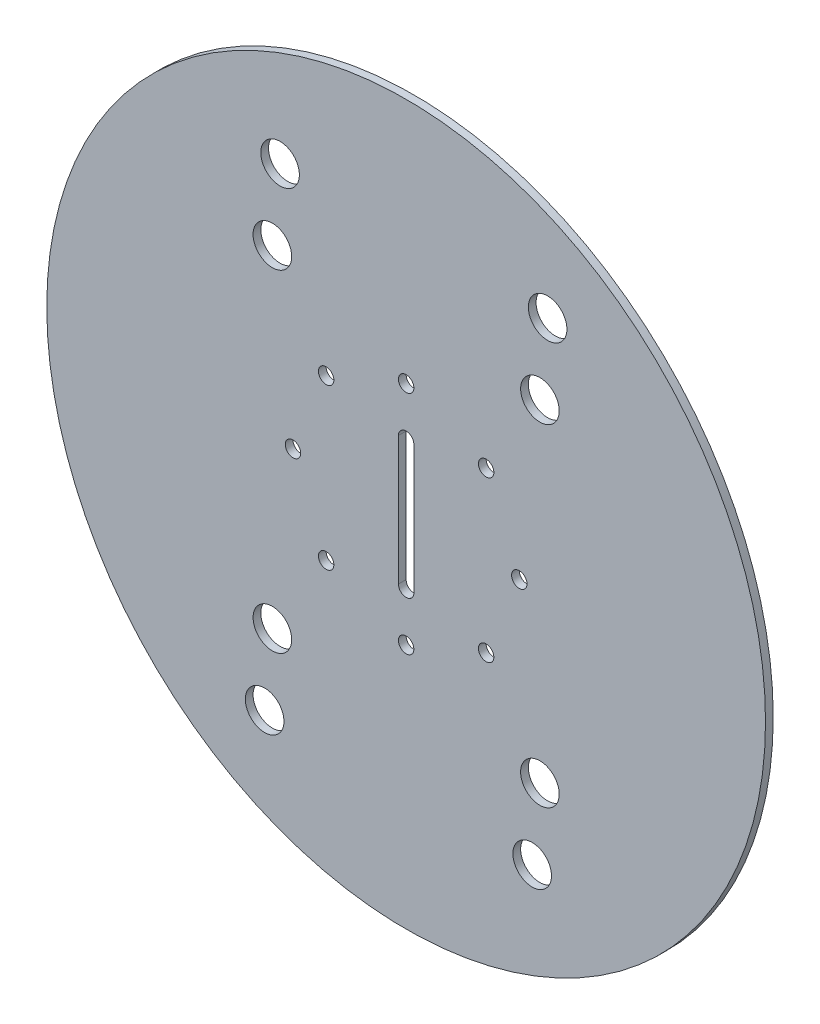
ISO-10303-21;
HEADER;
FILE_DESCRIPTION(('STEP AP214'),'2;1');
FILE_NAME('part.step','',(''),(''),'','','');
FILE_SCHEMA(('AUTOMOTIVE_DESIGN { 1 0 10303 214 1 1 1 1 }'));
ENDSEC;
DATA;
#1=APPLICATION_CONTEXT('core data for automotive mechanical design processes');
#2=APPLICATION_PROTOCOL_DEFINITION('international standard','automotive_design',2000,#1);
#3=PRODUCT_CONTEXT('',#1,'mechanical');
#4=PRODUCT('Part','Part','',(#3));
#5=PRODUCT_RELATED_PRODUCT_CATEGORY('part','',(#4));
#6=PRODUCT_DEFINITION_FORMATION('','',#4);
#7=PRODUCT_DEFINITION_CONTEXT('part definition',#1,'design');
#8=PRODUCT_DEFINITION('design','',#6,#7);
#9=PRODUCT_DEFINITION_SHAPE('','',#8);
#10=(LENGTH_UNIT() NAMED_UNIT(*) SI_UNIT(.MILLI.,.METRE.));
#11=(NAMED_UNIT(*) PLANE_ANGLE_UNIT() SI_UNIT($,.RADIAN.));
#12=(NAMED_UNIT(*) SI_UNIT($,.STERADIAN.) SOLID_ANGLE_UNIT());
#13=UNCERTAINTY_MEASURE_WITH_UNIT(LENGTH_MEASURE(1.E-05),#10,'distance_accuracy_value','');
#14=(GEOMETRIC_REPRESENTATION_CONTEXT(3) GLOBAL_UNCERTAINTY_ASSIGNED_CONTEXT((#13)) GLOBAL_UNIT_ASSIGNED_CONTEXT((#10,
#11,#12)) REPRESENTATION_CONTEXT('',''));
#15=CARTESIAN_POINT('',(0.,0.,0.));
#16=DIRECTION('',(0.,0.,1.));
#17=DIRECTION('',(1.,0.,0.));
#18=AXIS2_PLACEMENT_3D('',#15,#16,#17);
#19=CARTESIAN_POINT('',(0.,0.,3.));
#20=DIRECTION('',(0.,0.,-1.));
#21=DIRECTION('',(-1.,0.,0.));
#22=AXIS2_PLACEMENT_3D('',#19,#20,#21);
#23=CYLINDRICAL_SURFACE('',#22,139.700000000005);
#24=CARTESIAN_POINT('',(0.,0.,3.));
#25=DIRECTION('',(0.,0.,1.));
#26=DIRECTION('',(1.,0.,0.));
#27=AXIS2_PLACEMENT_3D('',#24,#25,#26);
#28=CIRCLE('',#27,139.700000000005);
#29=CARTESIAN_POINT('',(139.700000000005,0.,3.));
#30=VERTEX_POINT('',#29);
#31=EDGE_CURVE('E11',#30,#30,#28,.T.);
#32=ORIENTED_EDGE('',*,*,#31,.F.);
#33=EDGE_LOOP('',(#32));
#34=FACE_BOUND('',#33,.T.);
#35=CARTESIAN_POINT('',(0.,0.,0.));
#36=DIRECTION('',(0.,0.,1.));
#37=DIRECTION('',(1.,0.,0.));
#38=AXIS2_PLACEMENT_3D('',#35,#36,#37);
#39=CIRCLE('',#38,139.700000000005);
#40=CARTESIAN_POINT('',(139.700000000005,0.,0.));
#41=VERTEX_POINT('',#40);
#42=EDGE_CURVE('E35',#41,#41,#39,.T.);
#43=ORIENTED_EDGE('',*,*,#42,.T.);
#44=EDGE_LOOP('',(#43));
#45=FACE_BOUND('',#44,.T.);
#46=ADVANCED_FACE('F32',(#34,#45),#23,.T.);
#47=CARTESIAN_POINT('',(0.,0.,3.));
#48=DIRECTION('',(0.,0.,1.));
#49=DIRECTION('',(1.,0.,0.));
#50=AXIS2_PLACEMENT_3D('',#47,#48,#49);
#51=PLANE('',#50);
#52=CARTESIAN_POINT('',(-48.9999999999994,93.5000000000003,3.));
#53=DIRECTION('',(0.,0.,1.));
#54=DIRECTION('',(1.,0.,0.));
#55=AXIS2_PLACEMENT_3D('',#52,#53,#54);
#56=CIRCLE('',#55,7.50000000000002);
#57=CARTESIAN_POINT('',(-41.4999999999994,93.5000000000003,3.));
#58=VERTEX_POINT('',#57);
#59=EDGE_CURVE('E221',#58,#58,#56,.T.);
#60=ORIENTED_EDGE('',*,*,#59,.F.);
#61=EDGE_LOOP('',(#60));
#62=FACE_BOUND('',#61,.T.);
#63=CARTESIAN_POINT('',(-51.9999999999996,64.5000000000003,3.));
#64=DIRECTION('',(0.,0.,1.));
#65=DIRECTION('',(-1.,0.,0.));
#66=AXIS2_PLACEMENT_3D('',#63,#64,#65);
#67=CIRCLE('',#66,7.5);
#68=CARTESIAN_POINT('',(-59.4999999999996,64.5000000000003,3.));
#69=VERTEX_POINT('',#68);
#70=EDGE_CURVE('E223',#69,#69,#67,.T.);
#71=ORIENTED_EDGE('',*,*,#70,.F.);
#72=EDGE_LOOP('',(#71));
#73=FACE_BOUND('',#72,.T.);
#74=CARTESIAN_POINT('',(49.,-93.5,3.));
#75=DIRECTION('',(0.,0.,1.));
#76=DIRECTION('',(1.,0.,0.));
#77=AXIS2_PLACEMENT_3D('',#74,#75,#76);
#78=CIRCLE('',#77,7.50000000000001);
#79=CARTESIAN_POINT('',(56.5000000000001,-93.5,3.));
#80=VERTEX_POINT('',#79);
#81=EDGE_CURVE('E229',#80,#80,#78,.T.);
#82=ORIENTED_EDGE('',*,*,#81,.F.);
#83=EDGE_LOOP('',(#82));
#84=FACE_BOUND('',#83,.T.);
#85=CARTESIAN_POINT('',(55.0000000000006,93.4999999999996,3.));
#86=DIRECTION('',(0.,0.,1.));
#87=DIRECTION('',(1.,0.,0.));
#88=AXIS2_PLACEMENT_3D('',#85,#86,#87);
#89=CIRCLE('',#88,7.50000000000001);
#90=CARTESIAN_POINT('',(62.5000000000006,93.4999999999996,3.));
#91=VERTEX_POINT('',#90);
#92=EDGE_CURVE('E235',#91,#91,#89,.T.);
#93=ORIENTED_EDGE('',*,*,#92,.F.);
#94=EDGE_LOOP('',(#93));
#95=FACE_BOUND('',#94,.T.);
#96=CARTESIAN_POINT('',(52.0000000000004,64.4999999999996,3.));
#97=DIRECTION('',(0.,0.,1.));
#98=DIRECTION('',(1.,0.,0.));
#99=AXIS2_PLACEMENT_3D('',#96,#97,#98);
#100=CIRCLE('',#99,7.5);
#101=CARTESIAN_POINT('',(59.5000000000004,64.4999999999996,3.));
#102=VERTEX_POINT('',#101);
#103=EDGE_CURVE('E241',#102,#102,#100,.T.);
#104=ORIENTED_EDGE('',*,*,#103,.F.);
#105=EDGE_LOOP('',(#104));
#106=FACE_BOUND('',#105,.T.);
#107=CARTESIAN_POINT('',(52.,-64.4999999999999,3.));
#108=DIRECTION('',(0.,0.,1.));
#109=DIRECTION('',(-1.,0.,0.));
#110=AXIS2_PLACEMENT_3D('',#107,#108,#109);
#111=CIRCLE('',#110,7.5);
#112=CARTESIAN_POINT('',(44.5,-64.4999999999999,3.));
#113=VERTEX_POINT('',#112);
#114=EDGE_CURVE('E247',#113,#113,#111,.T.);
#115=ORIENTED_EDGE('',*,*,#114,.F.);
#116=EDGE_LOOP('',(#115));
#117=FACE_BOUND('',#116,.T.);
#118=CARTESIAN_POINT('',(-55.,-93.5,3.));
#119=DIRECTION('',(0.,0.,1.));
#120=DIRECTION('',(1.,0.,0.));
#121=AXIS2_PLACEMENT_3D('',#118,#119,#120);
#122=CIRCLE('',#121,7.50000000000001);
#123=CARTESIAN_POINT('',(-47.5,-93.5,3.));
#124=VERTEX_POINT('',#123);
#125=EDGE_CURVE('E253',#124,#124,#122,.T.);
#126=ORIENTED_EDGE('',*,*,#125,.F.);
#127=EDGE_LOOP('',(#126));
#128=FACE_BOUND('',#127,.T.);
#129=CARTESIAN_POINT('',(-52.,-64.5,3.));
#130=DIRECTION('',(0.,0.,1.));
#131=DIRECTION('',(1.,0.,0.));
#132=AXIS2_PLACEMENT_3D('',#129,#130,#131);
#133=CIRCLE('',#132,7.5);
#134=CARTESIAN_POINT('',(-44.5,-64.5,3.));
#135=VERTEX_POINT('',#134);
#136=EDGE_CURVE('E259',#135,#135,#133,.T.);
#137=ORIENTED_EDGE('',*,*,#136,.F.);
#138=EDGE_LOOP('',(#137));
#139=FACE_BOUND('',#138,.T.);
#140=CARTESIAN_POINT('',(-31.0988118755293,31.0988118755301,3.));
#141=DIRECTION('',(0.,0.,1.));
#142=DIRECTION('',(1.,0.,0.));
#143=AXIS2_PLACEMENT_3D('',#140,#141,#142);
#144=CIRCLE('',#143,3.00000000000001);
#145=CARTESIAN_POINT('',(-28.0988118755293,31.0988118755301,3.));
#146=VERTEX_POINT('',#145);
#147=EDGE_CURVE('E265',#146,#146,#144,.T.);
#148=ORIENTED_EDGE('',*,*,#147,.F.);
#149=EDGE_LOOP('',(#148));
#150=FACE_BOUND('',#149,.T.);
#151=CARTESIAN_POINT('',(-43.9803615280636,4.88317124566267E-13,3.));
#152=DIRECTION('',(0.,0.,1.));
#153=DIRECTION('',(1.,0.,0.));
#154=AXIS2_PLACEMENT_3D('',#151,#152,#153);
#155=CIRCLE('',#154,3.);
#156=CARTESIAN_POINT('',(-40.9803615280636,4.88317124566267E-13,3.));
#157=VERTEX_POINT('',#156);
#158=EDGE_CURVE('E271',#157,#157,#155,.T.);
#159=ORIENTED_EDGE('',*,*,#158,.F.);
#160=EDGE_LOOP('',(#159));
#161=FACE_BOUND('',#160,.T.);
#162=CARTESIAN_POINT('',(-31.09881187553,-31.0988118755294,3.));
#163=DIRECTION('',(0.,0.,1.));
#164=DIRECTION('',(1.,0.,0.));
#165=AXIS2_PLACEMENT_3D('',#162,#163,#164);
#166=CIRCLE('',#165,3.00000000000001);
#167=CARTESIAN_POINT('',(-28.09881187553,-31.0988118755294,3.));
#168=VERTEX_POINT('',#167);
#169=EDGE_CURVE('E277',#168,#168,#166,.T.);
#170=ORIENTED_EDGE('',*,*,#169,.F.);
#171=EDGE_LOOP('',(#170));
#172=FACE_BOUND('',#171,.T.);
#173=CARTESIAN_POINT('',(-3.36950293566904E-13,-43.9803615280636,3.));
#174=DIRECTION('',(0.,0.,1.));
#175=DIRECTION('',(1.,0.,0.));
#176=AXIS2_PLACEMENT_3D('',#173,#174,#175);
#177=CIRCLE('',#176,3.);
#178=CARTESIAN_POINT('',(2.99999999999966,-43.9803615280636,3.));
#179=VERTEX_POINT('',#178);
#180=EDGE_CURVE('E283',#179,#179,#177,.T.);
#181=ORIENTED_EDGE('',*,*,#180,.F.);
#182=EDGE_LOOP('',(#181));
#183=FACE_BOUND('',#182,.T.);
#184=CARTESIAN_POINT('',(31.0988118755295,-31.0988118755281,3.));
#185=DIRECTION('',(0.,0.,1.));
#186=DIRECTION('',(1.,0.,0.));
#187=AXIS2_PLACEMENT_3D('',#184,#185,#186);
#188=CIRCLE('',#187,3.000000000002);
#189=CARTESIAN_POINT('',(34.0988118755315,-31.0988118755281,3.));
#190=VERTEX_POINT('',#189);
#191=EDGE_CURVE('E289',#190,#190,#188,.T.);
#192=ORIENTED_EDGE('',*,*,#191,.F.);
#193=EDGE_LOOP('',(#192));
#194=FACE_BOUND('',#193,.T.);
#195=CARTESIAN_POINT('',(43.9803615280636,1.67433452766419E-12,3.));
#196=DIRECTION('',(0.,0.,1.));
#197=DIRECTION('',(1.,0.,0.));
#198=AXIS2_PLACEMENT_3D('',#195,#196,#197);
#199=CIRCLE('',#198,3.00000000000267);
#200=CARTESIAN_POINT('',(46.9803615280662,1.67433452766419E-12,3.));
#201=VERTEX_POINT('',#200);
#202=EDGE_CURVE('E295',#201,#201,#199,.T.);
#203=ORIENTED_EDGE('',*,*,#202,.F.);
#204=EDGE_LOOP('',(#203));
#205=FACE_BOUND('',#204,.T.);
#206=CARTESIAN_POINT('',(31.0988118755293,31.0988118755301,3.));
#207=DIRECTION('',(0.,0.,1.));
#208=DIRECTION('',(1.,0.,0.));
#209=AXIS2_PLACEMENT_3D('',#206,#207,#208);
#210=CIRCLE('',#209,3.);
#211=CARTESIAN_POINT('',(34.0988118755293,31.0988118755301,3.));
#212=VERTEX_POINT('',#211);
#213=EDGE_CURVE('E96',#212,#212,#210,.T.);
#214=ORIENTED_EDGE('',*,*,#213,.F.);
#215=EDGE_LOOP('',(#214));
#216=FACE_BOUND('',#215,.T.);
#217=CARTESIAN_POINT('',(0.,25.,3.));
#218=DIRECTION('',(0.,0.,1.));
#219=DIRECTION('',(-1.,0.,0.));
#220=AXIS2_PLACEMENT_3D('',#217,#218,#219);
#221=CIRCLE('',#220,3.);
#222=CARTESIAN_POINT('',(3.,25.,3.));
#223=VERTEX_POINT('',#222);
#224=CARTESIAN_POINT('',(-3.,25.,3.));
#225=VERTEX_POINT('',#224);
#226=EDGE_CURVE('E46',#223,#225,#221,.T.);
#227=ORIENTED_EDGE('',*,*,#226,.F.);
#228=DIRECTION('',(0.,1.,0.));
#229=VECTOR('',#228,1.);
#230=CARTESIAN_POINT('',(3.,-25.,3.));
#231=LINE('',#230,#229);
#232=CARTESIAN_POINT('',(3.00000000000003,-25.,3.));
#233=VERTEX_POINT('',#232);
#234=EDGE_CURVE('E90',#233,#223,#231,.T.);
#235=ORIENTED_EDGE('',*,*,#234,.F.);
#236=CARTESIAN_POINT('',(0.,-25.,3.));
#237=DIRECTION('',(0.,0.,1.));
#238=DIRECTION('',(1.,0.,0.));
#239=AXIS2_PLACEMENT_3D('',#236,#237,#238);
#240=CIRCLE('',#239,3.);
#241=CARTESIAN_POINT('',(-3.,-25.,3.));
#242=VERTEX_POINT('',#241);
#243=EDGE_CURVE('E93',#242,#233,#240,.T.);
#244=ORIENTED_EDGE('',*,*,#243,.F.);
#245=DIRECTION('',(0.,-1.,0.));
#246=VECTOR('',#245,1.);
#247=CARTESIAN_POINT('',(-3.,-25.,3.));
#248=LINE('',#247,#246);
#249=EDGE_CURVE('E102',#225,#242,#248,.T.);
#250=ORIENTED_EDGE('',*,*,#249,.F.);
#251=EDGE_LOOP('',(#227,#235,#244,#250));
#252=FACE_BOUND('',#251,.T.);
#253=CARTESIAN_POINT('',(0.,43.9803615280636,3.));
#254=DIRECTION('',(0.,0.,1.));
#255=DIRECTION('',(1.,0.,0.));
#256=AXIS2_PLACEMENT_3D('',#253,#254,#255);
#257=CIRCLE('',#256,3.);
#258=CARTESIAN_POINT('',(3.00000000000004,43.9803615280636,3.));
#259=VERTEX_POINT('',#258);
#260=EDGE_CURVE('E109',#259,#259,#257,.T.);
#261=ORIENTED_EDGE('',*,*,#260,.F.);
#262=EDGE_LOOP('',(#261));
#263=FACE_BOUND('',#262,.T.);
#264=ORIENTED_EDGE('',*,*,#31,.T.);
#265=EDGE_LOOP('',(#264));
#266=FACE_BOUND('',#265,.T.);
#267=ADVANCED_FACE('F121',(#62,#73,#84,#95,#106,#117,#128,#139,#150,#161,#172,#183,#194,#205,
#216,#252,#263,#266),#51,.T.);
#268=CARTESIAN_POINT('',(0.,0.,0.));
#269=DIRECTION('',(0.,0.,1.));
#270=DIRECTION('',(1.,0.,0.));
#271=AXIS2_PLACEMENT_3D('',#268,#269,#270);
#272=PLANE('',#271);
#273=CARTESIAN_POINT('',(-48.9999999999994,93.5000000000003,0.));
#274=DIRECTION('',(0.,0.,1.));
#275=DIRECTION('',(1.,0.,0.));
#276=AXIS2_PLACEMENT_3D('',#273,#274,#275);
#277=CIRCLE('',#276,7.50000000000002);
#278=CARTESIAN_POINT('',(-41.4999999999994,93.5000000000003,0.));
#279=VERTEX_POINT('',#278);
#280=EDGE_CURVE('E218',#279,#279,#277,.T.);
#281=ORIENTED_EDGE('',*,*,#280,.T.);
#282=EDGE_LOOP('',(#281));
#283=FACE_BOUND('',#282,.T.);
#284=CARTESIAN_POINT('',(-51.9999999999996,64.5000000000003,0.));
#285=DIRECTION('',(0.,0.,1.));
#286=DIRECTION('',(-1.,0.,0.));
#287=AXIS2_PLACEMENT_3D('',#284,#285,#286);
#288=CIRCLE('',#287,7.5);
#289=CARTESIAN_POINT('',(-59.4999999999996,64.5000000000003,0.));
#290=VERTEX_POINT('',#289);
#291=EDGE_CURVE('E226',#290,#290,#288,.T.);
#292=ORIENTED_EDGE('',*,*,#291,.T.);
#293=EDGE_LOOP('',(#292));
#294=FACE_BOUND('',#293,.T.);
#295=CARTESIAN_POINT('',(49.,-93.5,0.));
#296=DIRECTION('',(0.,0.,1.));
#297=DIRECTION('',(1.,0.,0.));
#298=AXIS2_PLACEMENT_3D('',#295,#296,#297);
#299=CIRCLE('',#298,7.50000000000001);
#300=CARTESIAN_POINT('',(56.5000000000001,-93.5,0.));
#301=VERTEX_POINT('',#300);
#302=EDGE_CURVE('E232',#301,#301,#299,.T.);
#303=ORIENTED_EDGE('',*,*,#302,.T.);
#304=EDGE_LOOP('',(#303));
#305=FACE_BOUND('',#304,.T.);
#306=CARTESIAN_POINT('',(55.0000000000006,93.4999999999996,0.));
#307=DIRECTION('',(0.,0.,1.));
#308=DIRECTION('',(1.,0.,0.));
#309=AXIS2_PLACEMENT_3D('',#306,#307,#308);
#310=CIRCLE('',#309,7.50000000000001);
#311=CARTESIAN_POINT('',(62.5000000000006,93.4999999999996,0.));
#312=VERTEX_POINT('',#311);
#313=EDGE_CURVE('E238',#312,#312,#310,.T.);
#314=ORIENTED_EDGE('',*,*,#313,.T.);
#315=EDGE_LOOP('',(#314));
#316=FACE_BOUND('',#315,.T.);
#317=CARTESIAN_POINT('',(52.0000000000004,64.4999999999996,0.));
#318=DIRECTION('',(0.,0.,1.));
#319=DIRECTION('',(1.,0.,0.));
#320=AXIS2_PLACEMENT_3D('',#317,#318,#319);
#321=CIRCLE('',#320,7.5);
#322=CARTESIAN_POINT('',(59.5000000000004,64.4999999999996,0.));
#323=VERTEX_POINT('',#322);
#324=EDGE_CURVE('E244',#323,#323,#321,.T.);
#325=ORIENTED_EDGE('',*,*,#324,.T.);
#326=EDGE_LOOP('',(#325));
#327=FACE_BOUND('',#326,.T.);
#328=CARTESIAN_POINT('',(52.,-64.4999999999999,0.));
#329=DIRECTION('',(0.,0.,1.));
#330=DIRECTION('',(-1.,0.,0.));
#331=AXIS2_PLACEMENT_3D('',#328,#329,#330);
#332=CIRCLE('',#331,7.5);
#333=CARTESIAN_POINT('',(44.5,-64.4999999999999,0.));
#334=VERTEX_POINT('',#333);
#335=EDGE_CURVE('E250',#334,#334,#332,.T.);
#336=ORIENTED_EDGE('',*,*,#335,.T.);
#337=EDGE_LOOP('',(#336));
#338=FACE_BOUND('',#337,.T.);
#339=CARTESIAN_POINT('',(-55.,-93.5,0.));
#340=DIRECTION('',(0.,0.,1.));
#341=DIRECTION('',(1.,0.,0.));
#342=AXIS2_PLACEMENT_3D('',#339,#340,#341);
#343=CIRCLE('',#342,7.50000000000001);
#344=CARTESIAN_POINT('',(-47.5,-93.5,0.));
#345=VERTEX_POINT('',#344);
#346=EDGE_CURVE('E256',#345,#345,#343,.T.);
#347=ORIENTED_EDGE('',*,*,#346,.T.);
#348=EDGE_LOOP('',(#347));
#349=FACE_BOUND('',#348,.T.);
#350=CARTESIAN_POINT('',(-52.,-64.5,0.));
#351=DIRECTION('',(0.,0.,1.));
#352=DIRECTION('',(1.,0.,0.));
#353=AXIS2_PLACEMENT_3D('',#350,#351,#352);
#354=CIRCLE('',#353,7.5);
#355=CARTESIAN_POINT('',(-44.5,-64.5,0.));
#356=VERTEX_POINT('',#355);
#357=EDGE_CURVE('E262',#356,#356,#354,.T.);
#358=ORIENTED_EDGE('',*,*,#357,.T.);
#359=EDGE_LOOP('',(#358));
#360=FACE_BOUND('',#359,.T.);
#361=CARTESIAN_POINT('',(-31.0988118755293,31.0988118755301,0.));
#362=DIRECTION('',(0.,0.,1.));
#363=DIRECTION('',(1.,0.,0.));
#364=AXIS2_PLACEMENT_3D('',#361,#362,#363);
#365=CIRCLE('',#364,3.00000000000001);
#366=CARTESIAN_POINT('',(-28.0988118755293,31.0988118755301,0.));
#367=VERTEX_POINT('',#366);
#368=EDGE_CURVE('E268',#367,#367,#365,.T.);
#369=ORIENTED_EDGE('',*,*,#368,.T.);
#370=EDGE_LOOP('',(#369));
#371=FACE_BOUND('',#370,.T.);
#372=CARTESIAN_POINT('',(-43.9803615280636,4.88317124566267E-13,0.));
#373=DIRECTION('',(0.,0.,1.));
#374=DIRECTION('',(1.,0.,0.));
#375=AXIS2_PLACEMENT_3D('',#372,#373,#374);
#376=CIRCLE('',#375,3.);
#377=CARTESIAN_POINT('',(-40.9803615280636,4.88317124566267E-13,0.));
#378=VERTEX_POINT('',#377);
#379=EDGE_CURVE('E274',#378,#378,#376,.T.);
#380=ORIENTED_EDGE('',*,*,#379,.T.);
#381=EDGE_LOOP('',(#380));
#382=FACE_BOUND('',#381,.T.);
#383=CARTESIAN_POINT('',(-31.09881187553,-31.0988118755294,0.));
#384=DIRECTION('',(0.,0.,1.));
#385=DIRECTION('',(1.,0.,0.));
#386=AXIS2_PLACEMENT_3D('',#383,#384,#385);
#387=CIRCLE('',#386,3.00000000000001);
#388=CARTESIAN_POINT('',(-28.09881187553,-31.0988118755294,0.));
#389=VERTEX_POINT('',#388);
#390=EDGE_CURVE('E280',#389,#389,#387,.T.);
#391=ORIENTED_EDGE('',*,*,#390,.T.);
#392=EDGE_LOOP('',(#391));
#393=FACE_BOUND('',#392,.T.);
#394=CARTESIAN_POINT('',(-3.36950293566904E-13,-43.9803615280636,0.));
#395=DIRECTION('',(0.,0.,1.));
#396=DIRECTION('',(1.,0.,0.));
#397=AXIS2_PLACEMENT_3D('',#394,#395,#396);
#398=CIRCLE('',#397,3.);
#399=CARTESIAN_POINT('',(2.99999999999966,-43.9803615280636,0.));
#400=VERTEX_POINT('',#399);
#401=EDGE_CURVE('E286',#400,#400,#398,.T.);
#402=ORIENTED_EDGE('',*,*,#401,.T.);
#403=EDGE_LOOP('',(#402));
#404=FACE_BOUND('',#403,.T.);
#405=CARTESIAN_POINT('',(31.0988118755295,-31.0988118755281,0.));
#406=DIRECTION('',(0.,0.,1.));
#407=DIRECTION('',(1.,0.,0.));
#408=AXIS2_PLACEMENT_3D('',#405,#406,#407);
#409=CIRCLE('',#408,3.000000000002);
#410=CARTESIAN_POINT('',(34.0988118755315,-31.0988118755281,0.));
#411=VERTEX_POINT('',#410);
#412=EDGE_CURVE('E292',#411,#411,#409,.T.);
#413=ORIENTED_EDGE('',*,*,#412,.T.);
#414=EDGE_LOOP('',(#413));
#415=FACE_BOUND('',#414,.T.);
#416=CARTESIAN_POINT('',(43.9803615280636,1.67433452766419E-12,0.));
#417=DIRECTION('',(0.,0.,1.));
#418=DIRECTION('',(1.,0.,0.));
#419=AXIS2_PLACEMENT_3D('',#416,#417,#418);
#420=CIRCLE('',#419,3.00000000000267);
#421=CARTESIAN_POINT('',(46.9803615280662,1.67433452766419E-12,0.));
#422=VERTEX_POINT('',#421);
#423=EDGE_CURVE('E298',#422,#422,#420,.T.);
#424=ORIENTED_EDGE('',*,*,#423,.T.);
#425=EDGE_LOOP('',(#424));
#426=FACE_BOUND('',#425,.T.);
#427=CARTESIAN_POINT('',(31.0988118755293,31.0988118755301,0.));
#428=DIRECTION('',(0.,0.,1.));
#429=DIRECTION('',(1.,0.,0.));
#430=AXIS2_PLACEMENT_3D('',#427,#428,#429);
#431=CIRCLE('',#430,3.);
#432=CARTESIAN_POINT('',(34.0988118755293,31.0988118755301,0.));
#433=VERTEX_POINT('',#432);
#434=EDGE_CURVE('E103',#433,#433,#431,.T.);
#435=ORIENTED_EDGE('',*,*,#434,.T.);
#436=EDGE_LOOP('',(#435));
#437=FACE_BOUND('',#436,.T.);
#438=DIRECTION('',(0.,1.,0.));
#439=VECTOR('',#438,1.);
#440=CARTESIAN_POINT('',(3.,-25.,0.));
#441=LINE('',#440,#439);
#442=CARTESIAN_POINT('',(3.00000000000003,-25.,0.));
#443=VERTEX_POINT('',#442);
#444=CARTESIAN_POINT('',(3.,25.,0.));
#445=VERTEX_POINT('',#444);
#446=EDGE_CURVE('E80',#443,#445,#441,.T.);
#447=ORIENTED_EDGE('',*,*,#446,.T.);
#448=CARTESIAN_POINT('',(0.,25.,0.));
#449=DIRECTION('',(0.,0.,1.));
#450=DIRECTION('',(-1.,0.,0.));
#451=AXIS2_PLACEMENT_3D('',#448,#449,#450);
#452=CIRCLE('',#451,3.);
#453=CARTESIAN_POINT('',(-3.,25.,0.));
#454=VERTEX_POINT('',#453);
#455=EDGE_CURVE('E74',#445,#454,#452,.T.);
#456=ORIENTED_EDGE('',*,*,#455,.T.);
#457=DIRECTION('',(0.,-1.,0.));
#458=VECTOR('',#457,1.);
#459=CARTESIAN_POINT('',(-3.,-25.,0.));
#460=LINE('',#459,#458);
#461=CARTESIAN_POINT('',(-3.,-25.,0.));
#462=VERTEX_POINT('',#461);
#463=EDGE_CURVE('E83',#454,#462,#460,.T.);
#464=ORIENTED_EDGE('',*,*,#463,.T.);
#465=CARTESIAN_POINT('',(0.,-25.,0.));
#466=DIRECTION('',(0.,0.,1.));
#467=DIRECTION('',(1.,0.,0.));
#468=AXIS2_PLACEMENT_3D('',#465,#466,#467);
#469=CIRCLE('',#468,3.);
#470=EDGE_CURVE('E54',#462,#443,#469,.T.);
#471=ORIENTED_EDGE('',*,*,#470,.T.);
#472=EDGE_LOOP('',(#447,#456,#464,#471));
#473=FACE_BOUND('',#472,.T.);
#474=CARTESIAN_POINT('',(0.,43.9803615280636,0.));
#475=DIRECTION('',(0.,0.,1.));
#476=DIRECTION('',(1.,0.,0.));
#477=AXIS2_PLACEMENT_3D('',#474,#475,#476);
#478=CIRCLE('',#477,3.);
#479=CARTESIAN_POINT('',(3.00000000000004,43.9803615280636,0.));
#480=VERTEX_POINT('',#479);
#481=EDGE_CURVE('E113',#480,#480,#478,.T.);
#482=ORIENTED_EDGE('',*,*,#481,.T.);
#483=EDGE_LOOP('',(#482));
#484=FACE_BOUND('',#483,.T.);
#485=ORIENTED_EDGE('',*,*,#42,.F.);
#486=EDGE_LOOP('',(#485));
#487=FACE_BOUND('',#486,.T.);
#488=ADVANCED_FACE('F87',(#283,#294,#305,#316,#327,#338,#349,#360,#371,#382,#393,#404,#415,#426,
#437,#473,#484,#487),#272,.F.);
#489=CARTESIAN_POINT('',(0.,43.9803615280636,0.));
#490=DIRECTION('',(0.,0.,1.));
#491=DIRECTION('',(1.,0.,0.));
#492=AXIS2_PLACEMENT_3D('',#489,#490,#491);
#493=CYLINDRICAL_SURFACE('',#492,3.);
#494=ORIENTED_EDGE('',*,*,#481,.F.);
#495=EDGE_LOOP('',(#494));
#496=FACE_BOUND('',#495,.T.);
#497=ORIENTED_EDGE('',*,*,#260,.T.);
#498=EDGE_LOOP('',(#497));
#499=FACE_BOUND('',#498,.T.);
#500=ADVANCED_FACE('F119',(#496,#499),#493,.F.);
#501=CARTESIAN_POINT('',(0.,25.,0.));
#502=DIRECTION('',(0.,0.,1.));
#503=DIRECTION('',(1.,0.,0.));
#504=AXIS2_PLACEMENT_3D('',#501,#502,#503);
#505=CYLINDRICAL_SURFACE('',#504,3.);
#506=ORIENTED_EDGE('',*,*,#226,.T.);
#507=DIRECTION('',(0.,0.,1.));
#508=VECTOR('',#507,1.);
#509=CARTESIAN_POINT('',(-3.,25.,0.));
#510=LINE('',#509,#508);
#511=EDGE_CURVE('E70',#454,#225,#510,.T.);
#512=ORIENTED_EDGE('',*,*,#511,.F.);
#513=ORIENTED_EDGE('',*,*,#455,.F.);
#514=DIRECTION('',(0.,0.,1.));
#515=VECTOR('',#514,1.);
#516=CARTESIAN_POINT('',(3.,25.,0.));
#517=LINE('',#516,#515);
#518=EDGE_CURVE('E107',#445,#223,#517,.T.);
#519=ORIENTED_EDGE('',*,*,#518,.T.);
#520=EDGE_LOOP('',(#506,#512,#513,#519));
#521=FACE_BOUND('',#520,.T.);
#522=ADVANCED_FACE('F72',(#521),#505,.F.);
#523=CARTESIAN_POINT('',(3.,-25.,0.));
#524=DIRECTION('',(1.,0.,0.));
#525=DIRECTION('',(0.,0.,-1.));
#526=AXIS2_PLACEMENT_3D('',#523,#524,#525);
#527=PLANE('',#526);
#528=ORIENTED_EDGE('',*,*,#234,.T.);
#529=ORIENTED_EDGE('',*,*,#518,.F.);
#530=ORIENTED_EDGE('',*,*,#446,.F.);
#531=DIRECTION('',(0.,0.,1.));
#532=VECTOR('',#531,1.);
#533=CARTESIAN_POINT('',(3.00000000000003,-25.,0.));
#534=LINE('',#533,#532);
#535=EDGE_CURVE('E110',#443,#233,#534,.T.);
#536=ORIENTED_EDGE('',*,*,#535,.T.);
#537=EDGE_LOOP('',(#528,#529,#530,#536));
#538=FACE_BOUND('',#537,.T.);
#539=ADVANCED_FACE('F146',(#538),#527,.F.);
#540=CARTESIAN_POINT('',(0.,-25.,0.));
#541=DIRECTION('',(0.,0.,1.));
#542=DIRECTION('',(1.,0.,0.));
#543=AXIS2_PLACEMENT_3D('',#540,#541,#542);
#544=CYLINDRICAL_SURFACE('',#543,3.);
#545=ORIENTED_EDGE('',*,*,#243,.T.);
#546=ORIENTED_EDGE('',*,*,#535,.F.);
#547=ORIENTED_EDGE('',*,*,#470,.F.);
#548=DIRECTION('',(0.,0.,1.));
#549=VECTOR('',#548,1.);
#550=CARTESIAN_POINT('',(-3.,-25.,0.));
#551=LINE('',#550,#549);
#552=EDGE_CURVE('E79',#462,#242,#551,.T.);
#553=ORIENTED_EDGE('',*,*,#552,.T.);
#554=EDGE_LOOP('',(#545,#546,#547,#553));
#555=FACE_BOUND('',#554,.T.);
#556=ADVANCED_FACE('F150',(#555),#544,.F.);
#557=CARTESIAN_POINT('',(-3.,-25.,0.));
#558=DIRECTION('',(-1.,0.,0.));
#559=DIRECTION('',(0.,0.,1.));
#560=AXIS2_PLACEMENT_3D('',#557,#558,#559);
#561=PLANE('',#560);
#562=ORIENTED_EDGE('',*,*,#249,.T.);
#563=ORIENTED_EDGE('',*,*,#552,.F.);
#564=ORIENTED_EDGE('',*,*,#463,.F.);
#565=ORIENTED_EDGE('',*,*,#511,.T.);
#566=EDGE_LOOP('',(#562,#563,#564,#565));
#567=FACE_BOUND('',#566,.T.);
#568=ADVANCED_FACE('F84',(#567),#561,.F.);
#569=CARTESIAN_POINT('',(31.0988118755293,31.0988118755301,0.));
#570=DIRECTION('',(0.,0.,1.));
#571=DIRECTION('',(1.,0.,0.));
#572=AXIS2_PLACEMENT_3D('',#569,#570,#571);
#573=CYLINDRICAL_SURFACE('',#572,3.);
#574=ORIENTED_EDGE('',*,*,#434,.F.);
#575=EDGE_LOOP('',(#574));
#576=FACE_BOUND('',#575,.T.);
#577=ORIENTED_EDGE('',*,*,#213,.T.);
#578=EDGE_LOOP('',(#577));
#579=FACE_BOUND('',#578,.T.);
#580=ADVANCED_FACE('F149',(#576,#579),#573,.F.);
#581=CARTESIAN_POINT('',(43.9803615280636,1.67433452766419E-12,0.));
#582=DIRECTION('',(0.,0.,1.));
#583=DIRECTION('',(1.,0.,0.));
#584=AXIS2_PLACEMENT_3D('',#581,#582,#583);
#585=CYLINDRICAL_SURFACE('',#584,3.00000000000267);
#586=ORIENTED_EDGE('',*,*,#423,.F.);
#587=EDGE_LOOP('',(#586));
#588=FACE_BOUND('',#587,.T.);
#589=ORIENTED_EDGE('',*,*,#202,.T.);
#590=EDGE_LOOP('',(#589));
#591=FACE_BOUND('',#590,.T.);
#592=ADVANCED_FACE('F158',(#588,#591),#585,.F.);
#593=CARTESIAN_POINT('',(31.0988118755295,-31.0988118755281,0.));
#594=DIRECTION('',(0.,0.,1.));
#595=DIRECTION('',(1.,0.,0.));
#596=AXIS2_PLACEMENT_3D('',#593,#594,#595);
#597=CYLINDRICAL_SURFACE('',#596,3.000000000002);
#598=ORIENTED_EDGE('',*,*,#412,.F.);
#599=EDGE_LOOP('',(#598));
#600=FACE_BOUND('',#599,.T.);
#601=ORIENTED_EDGE('',*,*,#191,.T.);
#602=EDGE_LOOP('',(#601));
#603=FACE_BOUND('',#602,.T.);
#604=ADVANCED_FACE('F162',(#600,#603),#597,.F.);
#605=CARTESIAN_POINT('',(-3.36950293566904E-13,-43.9803615280636,0.));
#606=DIRECTION('',(0.,0.,1.));
#607=DIRECTION('',(1.,0.,0.));
#608=AXIS2_PLACEMENT_3D('',#605,#606,#607);
#609=CYLINDRICAL_SURFACE('',#608,3.);
#610=ORIENTED_EDGE('',*,*,#401,.F.);
#611=EDGE_LOOP('',(#610));
#612=FACE_BOUND('',#611,.T.);
#613=ORIENTED_EDGE('',*,*,#180,.T.);
#614=EDGE_LOOP('',(#613));
#615=FACE_BOUND('',#614,.T.);
#616=ADVANCED_FACE('F166',(#612,#615),#609,.F.);
#617=CARTESIAN_POINT('',(-31.09881187553,-31.0988118755294,0.));
#618=DIRECTION('',(0.,0.,1.));
#619=DIRECTION('',(1.,0.,0.));
#620=AXIS2_PLACEMENT_3D('',#617,#618,#619);
#621=CYLINDRICAL_SURFACE('',#620,3.00000000000001);
#622=ORIENTED_EDGE('',*,*,#390,.F.);
#623=EDGE_LOOP('',(#622));
#624=FACE_BOUND('',#623,.T.);
#625=ORIENTED_EDGE('',*,*,#169,.T.);
#626=EDGE_LOOP('',(#625));
#627=FACE_BOUND('',#626,.T.);
#628=ADVANCED_FACE('F170',(#624,#627),#621,.F.);
#629=CARTESIAN_POINT('',(-43.9803615280636,4.88317124566267E-13,0.));
#630=DIRECTION('',(0.,0.,1.));
#631=DIRECTION('',(1.,0.,0.));
#632=AXIS2_PLACEMENT_3D('',#629,#630,#631);
#633=CYLINDRICAL_SURFACE('',#632,3.);
#634=ORIENTED_EDGE('',*,*,#379,.F.);
#635=EDGE_LOOP('',(#634));
#636=FACE_BOUND('',#635,.T.);
#637=ORIENTED_EDGE('',*,*,#158,.T.);
#638=EDGE_LOOP('',(#637));
#639=FACE_BOUND('',#638,.T.);
#640=ADVANCED_FACE('F174',(#636,#639),#633,.F.);
#641=CARTESIAN_POINT('',(-31.0988118755293,31.0988118755301,0.));
#642=DIRECTION('',(0.,0.,1.));
#643=DIRECTION('',(1.,0.,0.));
#644=AXIS2_PLACEMENT_3D('',#641,#642,#643);
#645=CYLINDRICAL_SURFACE('',#644,3.00000000000001);
#646=ORIENTED_EDGE('',*,*,#368,.F.);
#647=EDGE_LOOP('',(#646));
#648=FACE_BOUND('',#647,.T.);
#649=ORIENTED_EDGE('',*,*,#147,.T.);
#650=EDGE_LOOP('',(#649));
#651=FACE_BOUND('',#650,.T.);
#652=ADVANCED_FACE('F178',(#648,#651),#645,.F.);
#653=CARTESIAN_POINT('',(-52.,-64.5,0.));
#654=DIRECTION('',(0.,0.,1.));
#655=DIRECTION('',(1.,0.,0.));
#656=AXIS2_PLACEMENT_3D('',#653,#654,#655);
#657=CYLINDRICAL_SURFACE('',#656,7.5);
#658=ORIENTED_EDGE('',*,*,#357,.F.);
#659=EDGE_LOOP('',(#658));
#660=FACE_BOUND('',#659,.T.);
#661=ORIENTED_EDGE('',*,*,#136,.T.);
#662=EDGE_LOOP('',(#661));
#663=FACE_BOUND('',#662,.T.);
#664=ADVANCED_FACE('F182',(#660,#663),#657,.F.);
#665=CARTESIAN_POINT('',(-55.,-93.5,0.));
#666=DIRECTION('',(0.,0.,1.));
#667=DIRECTION('',(1.,0.,0.));
#668=AXIS2_PLACEMENT_3D('',#665,#666,#667);
#669=CYLINDRICAL_SURFACE('',#668,7.50000000000001);
#670=ORIENTED_EDGE('',*,*,#346,.F.);
#671=EDGE_LOOP('',(#670));
#672=FACE_BOUND('',#671,.T.);
#673=ORIENTED_EDGE('',*,*,#125,.T.);
#674=EDGE_LOOP('',(#673));
#675=FACE_BOUND('',#674,.T.);
#676=ADVANCED_FACE('F186',(#672,#675),#669,.F.);
#677=CARTESIAN_POINT('',(52.,-64.4999999999999,0.));
#678=DIRECTION('',(0.,0.,1.));
#679=DIRECTION('',(1.,0.,0.));
#680=AXIS2_PLACEMENT_3D('',#677,#678,#679);
#681=CYLINDRICAL_SURFACE('',#680,7.5);
#682=ORIENTED_EDGE('',*,*,#335,.F.);
#683=EDGE_LOOP('',(#682));
#684=FACE_BOUND('',#683,.T.);
#685=ORIENTED_EDGE('',*,*,#114,.T.);
#686=EDGE_LOOP('',(#685));
#687=FACE_BOUND('',#686,.T.);
#688=ADVANCED_FACE('F190',(#684,#687),#681,.F.);
#689=CARTESIAN_POINT('',(52.0000000000004,64.4999999999996,0.));
#690=DIRECTION('',(0.,0.,1.));
#691=DIRECTION('',(1.,0.,0.));
#692=AXIS2_PLACEMENT_3D('',#689,#690,#691);
#693=CYLINDRICAL_SURFACE('',#692,7.5);
#694=ORIENTED_EDGE('',*,*,#324,.F.);
#695=EDGE_LOOP('',(#694));
#696=FACE_BOUND('',#695,.T.);
#697=ORIENTED_EDGE('',*,*,#103,.T.);
#698=EDGE_LOOP('',(#697));
#699=FACE_BOUND('',#698,.T.);
#700=ADVANCED_FACE('F194',(#696,#699),#693,.F.);
#701=CARTESIAN_POINT('',(55.0000000000006,93.4999999999996,0.));
#702=DIRECTION('',(0.,0.,1.));
#703=DIRECTION('',(1.,0.,0.));
#704=AXIS2_PLACEMENT_3D('',#701,#702,#703);
#705=CYLINDRICAL_SURFACE('',#704,7.50000000000001);
#706=ORIENTED_EDGE('',*,*,#313,.F.);
#707=EDGE_LOOP('',(#706));
#708=FACE_BOUND('',#707,.T.);
#709=ORIENTED_EDGE('',*,*,#92,.T.);
#710=EDGE_LOOP('',(#709));
#711=FACE_BOUND('',#710,.T.);
#712=ADVANCED_FACE('F198',(#708,#711),#705,.F.);
#713=CARTESIAN_POINT('',(49.,-93.5,0.));
#714=DIRECTION('',(0.,0.,1.));
#715=DIRECTION('',(1.,0.,0.));
#716=AXIS2_PLACEMENT_3D('',#713,#714,#715);
#717=CYLINDRICAL_SURFACE('',#716,7.50000000000001);
#718=ORIENTED_EDGE('',*,*,#302,.F.);
#719=EDGE_LOOP('',(#718));
#720=FACE_BOUND('',#719,.T.);
#721=ORIENTED_EDGE('',*,*,#81,.T.);
#722=EDGE_LOOP('',(#721));
#723=FACE_BOUND('',#722,.T.);
#724=ADVANCED_FACE('F202',(#720,#723),#717,.F.);
#725=CARTESIAN_POINT('',(-51.9999999999996,64.5000000000003,0.));
#726=DIRECTION('',(0.,0.,1.));
#727=DIRECTION('',(1.,0.,0.));
#728=AXIS2_PLACEMENT_3D('',#725,#726,#727);
#729=CYLINDRICAL_SURFACE('',#728,7.5);
#730=ORIENTED_EDGE('',*,*,#291,.F.);
#731=EDGE_LOOP('',(#730));
#732=FACE_BOUND('',#731,.T.);
#733=ORIENTED_EDGE('',*,*,#70,.T.);
#734=EDGE_LOOP('',(#733));
#735=FACE_BOUND('',#734,.T.);
#736=ADVANCED_FACE('F206',(#732,#735),#729,.F.);
#737=CARTESIAN_POINT('',(-48.9999999999994,93.5000000000003,0.));
#738=DIRECTION('',(0.,0.,1.));
#739=DIRECTION('',(1.,0.,0.));
#740=AXIS2_PLACEMENT_3D('',#737,#738,#739);
#741=CYLINDRICAL_SURFACE('',#740,7.50000000000002);
#742=ORIENTED_EDGE('',*,*,#280,.F.);
#743=EDGE_LOOP('',(#742));
#744=FACE_BOUND('',#743,.T.);
#745=ORIENTED_EDGE('',*,*,#59,.T.);
#746=EDGE_LOOP('',(#745));
#747=FACE_BOUND('',#746,.T.);
#748=ADVANCED_FACE('F210',(#744,#747),#741,.F.);
#749=CLOSED_SHELL('',(#46,#267,#488,#500,#522,#539,#556,#568,#580,#592,#604,#616,#628,#640,#652,
#664,#676,#688,#700,#712,#724,#736,#748));
#750=MANIFOLD_SOLID_BREP('B2',#749);
#751=ADVANCED_BREP_SHAPE_REPRESENTATION('',(#18,#750),#14);
#752=SHAPE_DEFINITION_REPRESENTATION(#9,#751);
ENDSEC;
END-ISO-10303-21;
